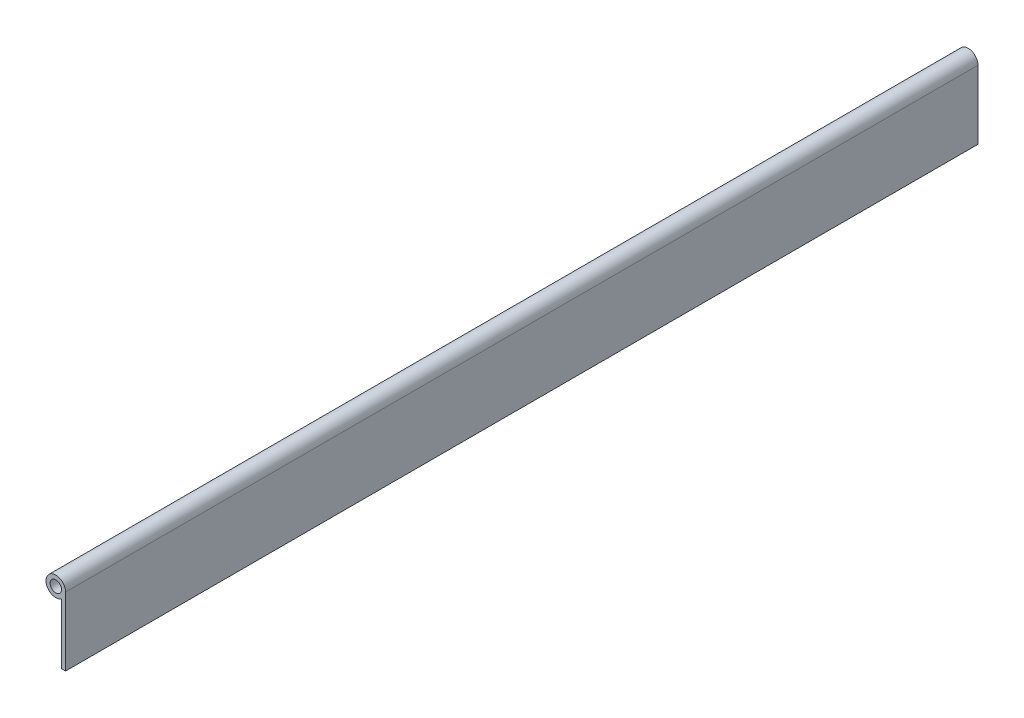
ISO-10303-21;
HEADER;
FILE_DESCRIPTION(('STEP AP214'),'2;1');
FILE_NAME('part.step','',(''),(''),'','','');
FILE_SCHEMA(('AUTOMOTIVE_DESIGN { 1 0 10303 214 1 1 1 1 }'));
ENDSEC;
DATA;
#1=APPLICATION_CONTEXT('core data for automotive mechanical design processes');
#2=APPLICATION_PROTOCOL_DEFINITION('international standard','automotive_design',2000,#1);
#3=PRODUCT_CONTEXT('',#1,'mechanical');
#4=PRODUCT('Part','Part','',(#3));
#5=PRODUCT_RELATED_PRODUCT_CATEGORY('part','',(#4));
#6=PRODUCT_DEFINITION_FORMATION('','',#4);
#7=PRODUCT_DEFINITION_CONTEXT('part definition',#1,'design');
#8=PRODUCT_DEFINITION('design','',#6,#7);
#9=PRODUCT_DEFINITION_SHAPE('','',#8);
#10=(LENGTH_UNIT() NAMED_UNIT(*) SI_UNIT(.MILLI.,.METRE.));
#11=(NAMED_UNIT(*) PLANE_ANGLE_UNIT() SI_UNIT($,.RADIAN.));
#12=(NAMED_UNIT(*) SI_UNIT($,.STERADIAN.) SOLID_ANGLE_UNIT());
#13=UNCERTAINTY_MEASURE_WITH_UNIT(LENGTH_MEASURE(1.E-05),#10,'distance_accuracy_value','');
#14=(GEOMETRIC_REPRESENTATION_CONTEXT(3) GLOBAL_UNCERTAINTY_ASSIGNED_CONTEXT((#13)) GLOBAL_UNIT_ASSIGNED_CONTEXT((#10,
#11,#12)) REPRESENTATION_CONTEXT('',''));
#15=CARTESIAN_POINT('',(0.,0.,0.));
#16=DIRECTION('',(0.,0.,1.));
#17=DIRECTION('',(1.,0.,0.));
#18=AXIS2_PLACEMENT_3D('',#15,#16,#17);
#19=CARTESIAN_POINT('',(0.,0.,508.));
#20=DIRECTION('',(0.,0.,1.));
#21=DIRECTION('',(1.,0.,0.));
#22=AXIS2_PLACEMENT_3D('',#19,#20,#21);
#23=PLANE('',#22);
#24=CARTESIAN_POINT('',(0.,0.,508.));
#25=DIRECTION('',(0.,0.,1.));
#26=DIRECTION('',(1.,0.,0.));
#27=AXIS2_PLACEMENT_3D('',#24,#25,#26);
#28=CIRCLE('',#27,5.461);
#29=CARTESIAN_POINT('',(5.461,0.,508.));
#30=VERTEX_POINT('',#29);
#31=CARTESIAN_POINT('',(3.17500000000001,-4.44318534387211,508.));
#32=VERTEX_POINT('',#31);
#33=EDGE_CURVE('E89',#30,#32,#28,.T.);
#34=ORIENTED_EDGE('',*,*,#33,.T.);
#35=DIRECTION('',(0.,-1.,0.));
#36=VECTOR('',#35,1.);
#37=CARTESIAN_POINT('',(3.17500000000001,-38.1,508.));
#38=LINE('',#37,#36);
#39=CARTESIAN_POINT('',(3.17500000000001,-38.1,508.));
#40=VERTEX_POINT('',#39);
#41=EDGE_CURVE('E84',#32,#40,#38,.T.);
#42=ORIENTED_EDGE('',*,*,#41,.T.);
#43=DIRECTION('',(1.,0.,0.));
#44=VECTOR('',#43,1.);
#45=CARTESIAN_POINT('',(5.461,-38.1,508.));
#46=LINE('',#45,#44);
#47=CARTESIAN_POINT('',(5.461,-38.1,508.));
#48=VERTEX_POINT('',#47);
#49=EDGE_CURVE('E87',#40,#48,#46,.T.);
#50=ORIENTED_EDGE('',*,*,#49,.T.);
#51=DIRECTION('',(0.,1.,0.));
#52=VECTOR('',#51,1.);
#53=CARTESIAN_POINT('',(5.461,0.,508.));
#54=LINE('',#53,#52);
#55=EDGE_CURVE('E54',#48,#30,#54,.T.);
#56=ORIENTED_EDGE('',*,*,#55,.T.);
#57=EDGE_LOOP('',(#34,#42,#50,#56));
#58=FACE_BOUND('',#57,.T.);
#59=CARTESIAN_POINT('',(0.,0.,508.));
#60=DIRECTION('',(0.,0.,1.));
#61=DIRECTION('',(1.,0.,0.));
#62=AXIS2_PLACEMENT_3D('',#59,#60,#61);
#63=CIRCLE('',#62,3.175);
#64=CARTESIAN_POINT('',(3.175,0.,508.));
#65=VERTEX_POINT('',#64);
#66=EDGE_CURVE('E104',#65,#65,#63,.T.);
#67=ORIENTED_EDGE('',*,*,#66,.F.);
#68=EDGE_LOOP('',(#67));
#69=FACE_BOUND('',#68,.T.);
#70=ADVANCED_FACE('F37',(#58,#69),#23,.T.);
#71=CARTESIAN_POINT('',(0.,0.,0.));
#72=DIRECTION('',(0.,0.,1.));
#73=DIRECTION('',(1.,0.,0.));
#74=AXIS2_PLACEMENT_3D('',#71,#72,#73);
#75=PLANE('',#74);
#76=CARTESIAN_POINT('',(0.,0.,0.));
#77=DIRECTION('',(0.,0.,1.));
#78=DIRECTION('',(1.,0.,0.));
#79=AXIS2_PLACEMENT_3D('',#76,#77,#78);
#80=CIRCLE('',#79,5.461);
#81=CARTESIAN_POINT('',(5.461,0.,0.));
#82=VERTEX_POINT('',#81);
#83=CARTESIAN_POINT('',(3.17500000000001,-4.44318534387211,0.));
#84=VERTEX_POINT('',#83);
#85=EDGE_CURVE('E101',#82,#84,#80,.T.);
#86=ORIENTED_EDGE('',*,*,#85,.F.);
#87=DIRECTION('',(0.,1.,0.));
#88=VECTOR('',#87,1.);
#89=CARTESIAN_POINT('',(5.461,0.,0.));
#90=LINE('',#89,#88);
#91=CARTESIAN_POINT('',(5.461,-38.1,0.));
#92=VERTEX_POINT('',#91);
#93=EDGE_CURVE('E77',#92,#82,#90,.T.);
#94=ORIENTED_EDGE('',*,*,#93,.F.);
#95=DIRECTION('',(1.,0.,0.));
#96=VECTOR('',#95,1.);
#97=CARTESIAN_POINT('',(5.461,-38.1,0.));
#98=LINE('',#97,#96);
#99=CARTESIAN_POINT('',(3.17500000000001,-38.1,0.));
#100=VERTEX_POINT('',#99);
#101=EDGE_CURVE('E71',#100,#92,#98,.T.);
#102=ORIENTED_EDGE('',*,*,#101,.F.);
#103=DIRECTION('',(0.,-1.,0.));
#104=VECTOR('',#103,1.);
#105=CARTESIAN_POINT('',(3.17500000000001,-38.1,0.));
#106=LINE('',#105,#104);
#107=EDGE_CURVE('E93',#84,#100,#106,.T.);
#108=ORIENTED_EDGE('',*,*,#107,.F.);
#109=EDGE_LOOP('',(#86,#94,#102,#108));
#110=FACE_BOUND('',#109,.T.);
#111=CARTESIAN_POINT('',(0.,0.,0.));
#112=DIRECTION('',(0.,0.,1.));
#113=DIRECTION('',(1.,0.,0.));
#114=AXIS2_PLACEMENT_3D('',#111,#112,#113);
#115=CIRCLE('',#114,3.175);
#116=CARTESIAN_POINT('',(3.175,0.,0.));
#117=VERTEX_POINT('',#116);
#118=EDGE_CURVE('E116',#117,#117,#115,.T.);
#119=ORIENTED_EDGE('',*,*,#118,.T.);
#120=EDGE_LOOP('',(#119));
#121=FACE_BOUND('',#120,.T.);
#122=ADVANCED_FACE('F112',(#110,#121),#75,.F.);
#123=CARTESIAN_POINT('',(0.,0.,508.));
#124=DIRECTION('',(0.,0.,-1.));
#125=DIRECTION('',(-1.,0.,0.));
#126=AXIS2_PLACEMENT_3D('',#123,#124,#125);
#127=CYLINDRICAL_SURFACE('',#126,5.461);
#128=ORIENTED_EDGE('',*,*,#85,.T.);
#129=DIRECTION('',(0.,0.,-1.));
#130=VECTOR('',#129,1.);
#131=CARTESIAN_POINT('',(3.17500000000001,-4.44318534387211,508.));
#132=LINE('',#131,#130);
#133=EDGE_CURVE('E11',#32,#84,#132,.T.);
#134=ORIENTED_EDGE('',*,*,#133,.F.);
#135=ORIENTED_EDGE('',*,*,#33,.F.);
#136=DIRECTION('',(0.,0.,-1.));
#137=VECTOR('',#136,1.);
#138=CARTESIAN_POINT('',(5.461,0.,508.));
#139=LINE('',#138,#137);
#140=EDGE_CURVE('E97',#30,#82,#139,.T.);
#141=ORIENTED_EDGE('',*,*,#140,.T.);
#142=EDGE_LOOP('',(#128,#134,#135,#141));
#143=FACE_BOUND('',#142,.T.);
#144=ADVANCED_FACE('F39',(#143),#127,.T.);
#145=CARTESIAN_POINT('',(3.17500000000001,-38.1,508.));
#146=DIRECTION('',(1.,0.,0.));
#147=DIRECTION('',(0.,1.,0.));
#148=AXIS2_PLACEMENT_3D('',#145,#146,#147);
#149=PLANE('',#148);
#150=ORIENTED_EDGE('',*,*,#107,.T.);
#151=DIRECTION('',(0.,0.,-1.));
#152=VECTOR('',#151,1.);
#153=CARTESIAN_POINT('',(3.17500000000001,-38.1,508.));
#154=LINE('',#153,#152);
#155=EDGE_CURVE('E46',#40,#100,#154,.T.);
#156=ORIENTED_EDGE('',*,*,#155,.F.);
#157=ORIENTED_EDGE('',*,*,#41,.F.);
#158=ORIENTED_EDGE('',*,*,#133,.T.);
#159=EDGE_LOOP('',(#150,#156,#157,#158));
#160=FACE_BOUND('',#159,.T.);
#161=ADVANCED_FACE('F92',(#160),#149,.F.);
#162=CARTESIAN_POINT('',(5.461,-38.1,508.));
#163=DIRECTION('',(0.,1.,0.));
#164=DIRECTION('',(0.,0.,1.));
#165=AXIS2_PLACEMENT_3D('',#162,#163,#164);
#166=PLANE('',#165);
#167=ORIENTED_EDGE('',*,*,#101,.T.);
#168=DIRECTION('',(0.,0.,-1.));
#169=VECTOR('',#168,1.);
#170=CARTESIAN_POINT('',(5.461,-38.1,508.));
#171=LINE('',#170,#169);
#172=EDGE_CURVE('E94',#48,#92,#171,.T.);
#173=ORIENTED_EDGE('',*,*,#172,.F.);
#174=ORIENTED_EDGE('',*,*,#49,.F.);
#175=ORIENTED_EDGE('',*,*,#155,.T.);
#176=EDGE_LOOP('',(#167,#173,#174,#175));
#177=FACE_BOUND('',#176,.T.);
#178=ADVANCED_FACE('F95',(#177),#166,.F.);
#179=CARTESIAN_POINT('',(5.461,0.,508.));
#180=DIRECTION('',(-1.,0.,0.));
#181=DIRECTION('',(0.,-1.,0.));
#182=AXIS2_PLACEMENT_3D('',#179,#180,#181);
#183=PLANE('',#182);
#184=ORIENTED_EDGE('',*,*,#93,.T.);
#185=ORIENTED_EDGE('',*,*,#140,.F.);
#186=ORIENTED_EDGE('',*,*,#55,.F.);
#187=ORIENTED_EDGE('',*,*,#172,.T.);
#188=EDGE_LOOP('',(#184,#185,#186,#187));
#189=FACE_BOUND('',#188,.T.);
#190=ADVANCED_FACE('F109',(#189),#183,.F.);
#191=CARTESIAN_POINT('',(0.,0.,508.));
#192=DIRECTION('',(0.,0.,-1.));
#193=DIRECTION('',(-1.,0.,0.));
#194=AXIS2_PLACEMENT_3D('',#191,#192,#193);
#195=CYLINDRICAL_SURFACE('',#194,3.175);
#196=ORIENTED_EDGE('',*,*,#66,.T.);
#197=EDGE_LOOP('',(#196));
#198=FACE_BOUND('',#197,.T.);
#199=ORIENTED_EDGE('',*,*,#118,.F.);
#200=EDGE_LOOP('',(#199));
#201=FACE_BOUND('',#200,.T.);
#202=ADVANCED_FACE('F122',(#198,#201),#195,.F.);
#203=CLOSED_SHELL('',(#70,#122,#144,#161,#178,#190,#202));
#204=MANIFOLD_SOLID_BREP('B2',#203);
#205=ADVANCED_BREP_SHAPE_REPRESENTATION('',(#18,#204),#14);
#206=SHAPE_DEFINITION_REPRESENTATION(#9,#205);
ENDSEC;
END-ISO-10303-21;
